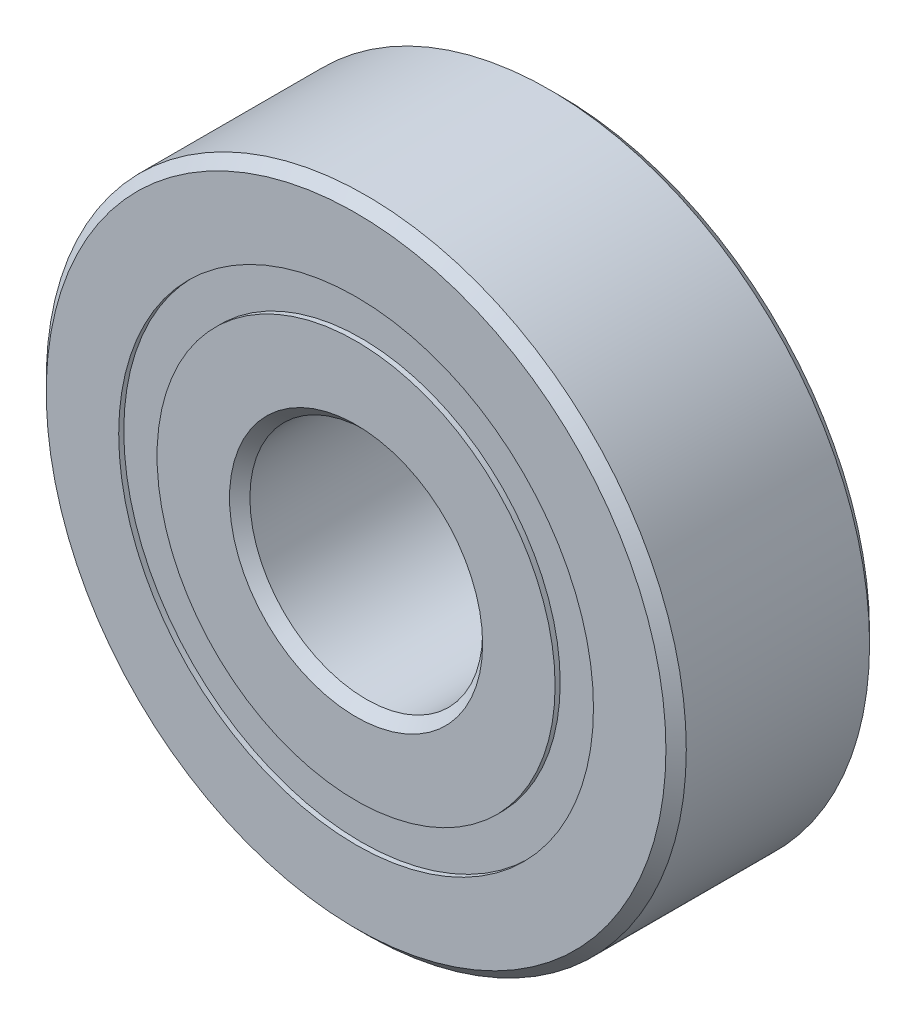
ISO-10303-21;
HEADER;
FILE_DESCRIPTION(('STEP AP214'),'2;1');
FILE_NAME('part.step','',(''),(''),'','','');
FILE_SCHEMA(('AUTOMOTIVE_DESIGN { 1 0 10303 214 1 1 1 1 }'));
ENDSEC;
DATA;
#1=APPLICATION_CONTEXT('core data for automotive mechanical design processes');
#2=APPLICATION_PROTOCOL_DEFINITION('international standard','automotive_design',2000,#1);
#3=PRODUCT_CONTEXT('',#1,'mechanical');
#4=PRODUCT('Part','Part','',(#3));
#5=PRODUCT_RELATED_PRODUCT_CATEGORY('part','',(#4));
#6=PRODUCT_DEFINITION_FORMATION('','',#4);
#7=PRODUCT_DEFINITION_CONTEXT('part definition',#1,'design');
#8=PRODUCT_DEFINITION('design','',#6,#7);
#9=PRODUCT_DEFINITION_SHAPE('','',#8);
#10=(LENGTH_UNIT() NAMED_UNIT(*) SI_UNIT(.MILLI.,.METRE.));
#11=(NAMED_UNIT(*) PLANE_ANGLE_UNIT() SI_UNIT($,.RADIAN.));
#12=(NAMED_UNIT(*) SI_UNIT($,.STERADIAN.) SOLID_ANGLE_UNIT());
#13=UNCERTAINTY_MEASURE_WITH_UNIT(LENGTH_MEASURE(1.E-05),#10,'distance_accuracy_value','');
#14=(GEOMETRIC_REPRESENTATION_CONTEXT(3) GLOBAL_UNCERTAINTY_ASSIGNED_CONTEXT((#13)) GLOBAL_UNIT_ASSIGNED_CONTEXT((#10,
#11,#12)) REPRESENTATION_CONTEXT('',''));
#15=CARTESIAN_POINT('',(0.,0.,0.));
#16=DIRECTION('',(0.,0.,1.));
#17=DIRECTION('',(1.,0.,0.));
#18=AXIS2_PLACEMENT_3D('',#15,#16,#17);
#19=CARTESIAN_POINT('',(0.,8.15934065934065,-3.32500000000001));
#20=DIRECTION('',(0.,0.,1.));
#21=DIRECTION('',(1.,0.,0.));
#22=AXIS2_PLACEMENT_3D('',#19,#20,#21);
#23=PLANE('',#22);
#24=CARTESIAN_POINT('',(0.,0.,-3.32500000000001));
#25=DIRECTION('',(0.,0.,1.));
#26=DIRECTION('',(1.,0.,0.));
#27=AXIS2_PLACEMENT_3D('',#24,#25,#26);
#28=CIRCLE('',#27,8.15934065934065);
#29=CARTESIAN_POINT('',(8.15934065934065,0.,-3.32500000000001));
#30=VERTEX_POINT('',#29);
#31=EDGE_CURVE('E58',#30,#30,#28,.T.);
#32=ORIENTED_EDGE('',*,*,#31,.F.);
#33=EDGE_LOOP('',(#32));
#34=FACE_BOUND('',#33,.T.);
#35=CARTESIAN_POINT('',(0.,0.,-3.32500000000001));
#36=DIRECTION('',(0.,0.,1.));
#37=DIRECTION('',(1.,0.,0.));
#38=AXIS2_PLACEMENT_3D('',#35,#36,#37);
#39=CIRCLE('',#38,6.84065934065934);
#40=CARTESIAN_POINT('',(6.84065934065934,0.,-3.32500000000001));
#41=VERTEX_POINT('',#40);
#42=EDGE_CURVE('E11',#41,#41,#39,.T.);
#43=ORIENTED_EDGE('',*,*,#42,.T.);
#44=EDGE_LOOP('',(#43));
#45=FACE_BOUND('',#44,.T.);
#46=ADVANCED_FACE('F44',(#34,#45),#23,.F.);
#47=CARTESIAN_POINT('',(0.,0.,3.5));
#48=DIRECTION('',(0.,0.,1.));
#49=DIRECTION('',(1.,0.,0.));
#50=AXIS2_PLACEMENT_3D('',#47,#48,#49);
#51=CYLINDRICAL_SURFACE('',#50,6.84065934065934);
#52=ORIENTED_EDGE('',*,*,#42,.F.);
#53=EDGE_LOOP('',(#52));
#54=FACE_BOUND('',#53,.T.);
#55=CARTESIAN_POINT('',(0.,0.,-1.68952158656809));
#56=DIRECTION('',(0.,0.,1.));
#57=DIRECTION('',(1.,0.,0.));
#58=AXIS2_PLACEMENT_3D('',#55,#56,#57);
#59=CIRCLE('',#58,6.84065934065934);
#60=CARTESIAN_POINT('',(6.84065934065934,0.,-1.68952158656809));
#61=VERTEX_POINT('',#60);
#62=EDGE_CURVE('E50',#61,#61,#59,.T.);
#63=ORIENTED_EDGE('',*,*,#62,.T.);
#64=EDGE_LOOP('',(#63));
#65=FACE_BOUND('',#64,.T.);
#66=ADVANCED_FACE('F67',(#54,#65),#51,.F.);
#67=CARTESIAN_POINT('',(0.,8.15934065934065,-1.68952158656809));
#68=DIRECTION('',(0.,0.,-1.));
#69=DIRECTION('',(-1.,0.,0.));
#70=AXIS2_PLACEMENT_3D('',#67,#68,#69);
#71=PLANE('',#70);
#72=ORIENTED_EDGE('',*,*,#62,.F.);
#73=EDGE_LOOP('',(#72));
#74=FACE_BOUND('',#73,.T.);
#75=CARTESIAN_POINT('',(0.,0.,-1.68952158656809));
#76=DIRECTION('',(0.,0.,1.));
#77=DIRECTION('',(1.,0.,0.));
#78=AXIS2_PLACEMENT_3D('',#75,#76,#77);
#79=CIRCLE('',#78,8.15934065934065);
#80=CARTESIAN_POINT('',(8.15934065934065,0.,-1.68952158656809));
#81=VERTEX_POINT('',#80);
#82=EDGE_CURVE('E54',#81,#81,#79,.T.);
#83=ORIENTED_EDGE('',*,*,#82,.T.);
#84=EDGE_LOOP('',(#83));
#85=FACE_BOUND('',#84,.T.);
#86=ADVANCED_FACE('F71',(#74,#85),#71,.F.);
#87=CARTESIAN_POINT('',(0.,0.,3.5));
#88=DIRECTION('',(0.,0.,1.));
#89=DIRECTION('',(1.,0.,0.));
#90=AXIS2_PLACEMENT_3D('',#87,#88,#89);
#91=CYLINDRICAL_SURFACE('',#90,8.15934065934065);
#92=ORIENTED_EDGE('',*,*,#82,.F.);
#93=EDGE_LOOP('',(#92));
#94=FACE_BOUND('',#93,.T.);
#95=ORIENTED_EDGE('',*,*,#31,.T.);
#96=EDGE_LOOP('',(#95));
#97=FACE_BOUND('',#96,.T.);
#98=ADVANCED_FACE('F64',(#94,#97),#91,.T.);
#99=CLOSED_SHELL('',(#46,#66,#86,#98));
#100=MANIFOLD_SOLID_BREP('B2_NOT_SHOWN',#99);
#101=CARTESIAN_POINT('',(0.,8.15934065934065,3.32499999999999));
#102=DIRECTION('',(0.,0.,-1.));
#103=DIRECTION('',(-1.,0.,0.));
#104=AXIS2_PLACEMENT_3D('',#101,#102,#103);
#105=PLANE('',#104);
#106=CARTESIAN_POINT('',(0.,0.,3.32499999999999));
#107=DIRECTION('',(0.,0.,1.));
#108=DIRECTION('',(1.,0.,0.));
#109=AXIS2_PLACEMENT_3D('',#106,#107,#108);
#110=CIRCLE('',#109,6.84065934065934);
#111=CARTESIAN_POINT('',(6.84065934065934,0.,3.32499999999999));
#112=VERTEX_POINT('',#111);
#113=EDGE_CURVE('E43',#112,#112,#110,.T.);
#114=ORIENTED_EDGE('',*,*,#113,.F.);
#115=EDGE_LOOP('',(#114));
#116=FACE_BOUND('',#115,.T.);
#117=CARTESIAN_POINT('',(0.,0.,3.32499999999999));
#118=DIRECTION('',(0.,0.,1.));
#119=DIRECTION('',(1.,0.,0.));
#120=AXIS2_PLACEMENT_3D('',#117,#118,#119);
#121=CIRCLE('',#120,8.15934065934065);
#122=CARTESIAN_POINT('',(8.15934065934065,0.,3.32499999999999));
#123=VERTEX_POINT('',#122);
#124=EDGE_CURVE('E126',#123,#123,#121,.T.);
#125=ORIENTED_EDGE('',*,*,#124,.T.);
#126=EDGE_LOOP('',(#125));
#127=FACE_BOUND('',#126,.T.);
#128=ADVANCED_FACE('F112',(#116,#127),#105,.F.);
#129=CARTESIAN_POINT('',(0.,0.,3.5));
#130=DIRECTION('',(0.,0.,1.));
#131=DIRECTION('',(1.,0.,0.));
#132=AXIS2_PLACEMENT_3D('',#129,#130,#131);
#133=CYLINDRICAL_SURFACE('',#132,6.84065934065934);
#134=CARTESIAN_POINT('',(0.,0.,1.68952158656808));
#135=DIRECTION('',(0.,0.,1.));
#136=DIRECTION('',(1.,0.,0.));
#137=AXIS2_PLACEMENT_3D('',#134,#135,#136);
#138=CIRCLE('',#137,6.84065934065934);
#139=CARTESIAN_POINT('',(6.84065934065934,0.,1.68952158656808));
#140=VERTEX_POINT('',#139);
#141=EDGE_CURVE('E118',#140,#140,#138,.T.);
#142=ORIENTED_EDGE('',*,*,#141,.F.);
#143=EDGE_LOOP('',(#142));
#144=FACE_BOUND('',#143,.T.);
#145=ORIENTED_EDGE('',*,*,#113,.T.);
#146=EDGE_LOOP('',(#145));
#147=FACE_BOUND('',#146,.T.);
#148=ADVANCED_FACE('F141',(#144,#147),#133,.F.);
#149=CARTESIAN_POINT('',(0.,8.15934065934065,1.68952158656808));
#150=DIRECTION('',(0.,0.,1.));
#151=DIRECTION('',(1.,0.,0.));
#152=AXIS2_PLACEMENT_3D('',#149,#150,#151);
#153=PLANE('',#152);
#154=CARTESIAN_POINT('',(0.,0.,1.68952158656808));
#155=DIRECTION('',(0.,0.,1.));
#156=DIRECTION('',(1.,0.,0.));
#157=AXIS2_PLACEMENT_3D('',#154,#155,#156);
#158=CIRCLE('',#157,8.15934065934065);
#159=CARTESIAN_POINT('',(8.15934065934065,0.,1.68952158656808));
#160=VERTEX_POINT('',#159);
#161=EDGE_CURVE('E122',#160,#160,#158,.T.);
#162=ORIENTED_EDGE('',*,*,#161,.F.);
#163=EDGE_LOOP('',(#162));
#164=FACE_BOUND('',#163,.T.);
#165=ORIENTED_EDGE('',*,*,#141,.T.);
#166=EDGE_LOOP('',(#165));
#167=FACE_BOUND('',#166,.T.);
#168=ADVANCED_FACE('F136',(#164,#167),#153,.F.);
#169=CARTESIAN_POINT('',(0.,0.,3.5));
#170=DIRECTION('',(0.,0.,1.));
#171=DIRECTION('',(1.,0.,0.));
#172=AXIS2_PLACEMENT_3D('',#169,#170,#171);
#173=CYLINDRICAL_SURFACE('',#172,8.15934065934065);
#174=ORIENTED_EDGE('',*,*,#124,.F.);
#175=EDGE_LOOP('',(#174));
#176=FACE_BOUND('',#175,.T.);
#177=ORIENTED_EDGE('',*,*,#161,.T.);
#178=EDGE_LOOP('',(#177));
#179=FACE_BOUND('',#178,.T.);
#180=ADVANCED_FACE('F133',(#176,#179),#173,.T.);
#181=CLOSED_SHELL('',(#128,#148,#168,#180));
#182=MANIFOLD_SOLID_BREP('B6_NOT_SHOWN',#181);
#183=CARTESIAN_POINT('',(-4.40838939219346,6.06762745781216,0.));
#184=DIRECTION('',(0.,0.,1.));
#185=DIRECTION('',(-0.587785252292462,0.809016994374955,0.));
#186=AXIS2_PLACEMENT_3D('',#183,#184,#185);
#187=SPHERICAL_SURFACE('',#186,1.68952158656808);
#188=CARTESIAN_POINT('',(-4.40838939219346,6.06762745781216,1.68952158656808));
#189=VERTEX_POINT('',#188);
#190=VERTEX_LOOP('',#189);
#191=FACE_BOUND('',#190,.T.);
#192=ADVANCED_FACE('F180',(#191),#187,.T.);
#193=CLOSED_SHELL('',(#192));
#194=MANIFOLD_SOLID_BREP('B38',#193);
#195=CARTESIAN_POINT('',(-7.13292387221362,2.31762745781218,0.));
#196=DIRECTION('',(0.,0.,1.));
#197=DIRECTION('',(-0.95105651629515,0.309016994374958,0.));
#198=AXIS2_PLACEMENT_3D('',#195,#196,#197);
#199=SPHERICAL_SURFACE('',#198,1.68952158656808);
#200=CARTESIAN_POINT('',(-7.13292387221362,2.31762745781218,1.68952158656808));
#201=VERTEX_POINT('',#200);
#202=VERTEX_LOOP('',#201);
#203=FACE_BOUND('',#202,.T.);
#204=ADVANCED_FACE('F201',(#203),#199,.T.);
#205=CLOSED_SHELL('',(#204));
#206=MANIFOLD_SOLID_BREP('B108',#205);
#207=CARTESIAN_POINT('',(-7.13292387221367,-2.31762745781203,0.));
#208=DIRECTION('',(0.,0.,1.));
#209=DIRECTION('',(-0.951056516295157,-0.309016994374938,0.));
#210=AXIS2_PLACEMENT_3D('',#207,#208,#209);
#211=SPHERICAL_SURFACE('',#210,1.68952158656808);
#212=CARTESIAN_POINT('',(-7.13292387221367,-2.31762745781203,1.68952158656808));
#213=VERTEX_POINT('',#212);
#214=VERTEX_LOOP('',#213);
#215=FACE_BOUND('',#214,.T.);
#216=ADVANCED_FACE('F222',(#215),#211,.T.);
#217=CLOSED_SHELL('',(#216));
#218=MANIFOLD_SOLID_BREP('B176',#217);
#219=CARTESIAN_POINT('',(-4.4083893921936,-6.06762745781206,0.));
#220=DIRECTION('',(0.,0.,1.));
#221=DIRECTION('',(-0.58778525229248,-0.809016994374942,0.));
#222=AXIS2_PLACEMENT_3D('',#219,#220,#221);
#223=SPHERICAL_SURFACE('',#222,1.68952158656808);
#224=CARTESIAN_POINT('',(-4.4083893921936,-6.06762745781206,1.68952158656808));
#225=VERTEX_POINT('',#224);
#226=VERTEX_LOOP('',#225);
#227=FACE_BOUND('',#226,.T.);
#228=ADVANCED_FACE('F243',(#227),#223,.T.);
#229=CLOSED_SHELL('',(#228));
#230=MANIFOLD_SOLID_BREP('B197',#229);
#231=CARTESIAN_POINT('',(0.,-7.49999999999999,0.));
#232=DIRECTION('',(0.,0.,1.));
#233=DIRECTION('',(0.,-1.,0.));
#234=AXIS2_PLACEMENT_3D('',#231,#232,#233);
#235=SPHERICAL_SURFACE('',#234,1.68952158656808);
#236=CARTESIAN_POINT('',(0.,-7.49999999999999,1.68952158656808));
#237=VERTEX_POINT('',#236);
#238=VERTEX_LOOP('',#237);
#239=FACE_BOUND('',#238,.T.);
#240=ADVANCED_FACE('F264',(#239),#235,.T.);
#241=CLOSED_SHELL('',(#240));
#242=MANIFOLD_SOLID_BREP('B218',#241);
#243=CARTESIAN_POINT('',(4.40838939219351,-6.06762745781212,0.));
#244=DIRECTION('',(0.,0.,1.));
#245=DIRECTION('',(0.587785252292469,-0.809016994374951,0.));
#246=AXIS2_PLACEMENT_3D('',#243,#244,#245);
#247=SPHERICAL_SURFACE('',#246,1.68952158656808);
#248=CARTESIAN_POINT('',(4.40838939219351,-6.06762745781212,1.68952158656808));
#249=VERTEX_POINT('',#248);
#250=VERTEX_LOOP('',#249);
#251=FACE_BOUND('',#250,.T.);
#252=ADVANCED_FACE('F285',(#251),#247,.T.);
#253=CLOSED_SHELL('',(#252));
#254=MANIFOLD_SOLID_BREP('B239',#253);
#255=CARTESIAN_POINT('',(7.13292387221364,-2.31762745781214,0.));
#256=DIRECTION('',(0.,0.,1.));
#257=DIRECTION('',(0.951056516295152,-0.309016994374952,0.));
#258=AXIS2_PLACEMENT_3D('',#255,#256,#257);
#259=SPHERICAL_SURFACE('',#258,1.68952158656808);
#260=CARTESIAN_POINT('',(7.13292387221364,-2.31762745781214,1.68952158656808));
#261=VERTEX_POINT('',#260);
#262=VERTEX_LOOP('',#261);
#263=FACE_BOUND('',#262,.T.);
#264=ADVANCED_FACE('F306',(#263),#259,.T.);
#265=CLOSED_SHELL('',(#264));
#266=MANIFOLD_SOLID_BREP('B260',#265);
#267=CARTESIAN_POINT('',(7.13292387221365,2.31762745781208,0.));
#268=DIRECTION('',(0.,0.,1.));
#269=DIRECTION('',(0.951056516295155,0.309016994374945,0.));
#270=AXIS2_PLACEMENT_3D('',#267,#268,#269);
#271=SPHERICAL_SURFACE('',#270,1.68952158656808);
#272=CARTESIAN_POINT('',(7.13292387221365,2.31762745781208,1.68952158656808));
#273=VERTEX_POINT('',#272);
#274=VERTEX_LOOP('',#273);
#275=FACE_BOUND('',#274,.T.);
#276=ADVANCED_FACE('F327',(#275),#271,.T.);
#277=CLOSED_SHELL('',(#276));
#278=MANIFOLD_SOLID_BREP('B281',#277);
#279=CARTESIAN_POINT('',(4.40838939219355,6.0676274578121,0.));
#280=DIRECTION('',(0.,0.,1.));
#281=DIRECTION('',(0.587785252292474,0.809016994374947,0.));
#282=AXIS2_PLACEMENT_3D('',#279,#280,#281);
#283=SPHERICAL_SURFACE('',#282,1.68952158656808);
#284=CARTESIAN_POINT('',(4.40838939219355,6.0676274578121,1.68952158656808));
#285=VERTEX_POINT('',#284);
#286=VERTEX_LOOP('',#285);
#287=FACE_BOUND('',#286,.T.);
#288=ADVANCED_FACE('F348',(#287),#283,.T.);
#289=CLOSED_SHELL('',(#288));
#290=MANIFOLD_SOLID_BREP('B302',#289);
#291=CARTESIAN_POINT('',(0.,7.49999999999999,0.));
#292=DIRECTION('',(0.,0.,1.));
#293=DIRECTION('',(0.,1.,0.));
#294=AXIS2_PLACEMENT_3D('',#291,#292,#293);
#295=SPHERICAL_SURFACE('',#294,1.68952158656808);
#296=CARTESIAN_POINT('',(0.,7.49999999999999,1.68952158656808));
#297=VERTEX_POINT('',#296);
#298=VERTEX_LOOP('',#297);
#299=FACE_BOUND('',#298,.T.);
#300=ADVANCED_FACE('F371',(#299),#295,.T.);
#301=CLOSED_SHELL('',(#300));
#302=MANIFOLD_SOLID_BREP('B323',#301);
#303=CARTESIAN_POINT('',(0.,6.84065934065934,3.50000000000001));
#304=DIRECTION('',(0.,0.,-1.));
#305=DIRECTION('',(-1.,0.,0.));
#306=AXIS2_PLACEMENT_3D('',#303,#304,#305);
#307=PLANE('',#306);
#308=CARTESIAN_POINT('',(0.,0.,3.50000000000001));
#309=DIRECTION('',(0.,0.,1.));
#310=DIRECTION('',(1.,0.,0.));
#311=AXIS2_PLACEMENT_3D('',#308,#309,#310);
#312=CIRCLE('',#311,4.35);
#313=CARTESIAN_POINT('',(4.35,0.,3.50000000000001));
#314=VERTEX_POINT('',#313);
#315=EDGE_CURVE('E419',#314,#314,#312,.T.);
#316=ORIENTED_EDGE('',*,*,#315,.F.);
#317=EDGE_LOOP('',(#316));
#318=FACE_BOUND('',#317,.T.);
#319=CARTESIAN_POINT('',(0.,0.,3.50000000000001));
#320=DIRECTION('',(0.,0.,1.));
#321=DIRECTION('',(1.,0.,0.));
#322=AXIS2_PLACEMENT_3D('',#319,#320,#321);
#323=CIRCLE('',#322,6.84065934065934);
#324=CARTESIAN_POINT('',(6.84065934065934,0.,3.50000000000001));
#325=VERTEX_POINT('',#324);
#326=EDGE_CURVE('E370',#325,#325,#323,.T.);
#327=ORIENTED_EDGE('',*,*,#326,.T.);
#328=EDGE_LOOP('',(#327));
#329=FACE_BOUND('',#328,.T.);
#330=ADVANCED_FACE('F391',(#318,#329),#307,.F.);
#331=CARTESIAN_POINT('',(0.,0.,3.5));
#332=DIRECTION('',(0.,0.,1.));
#333=DIRECTION('',(1.,0.,0.));
#334=AXIS2_PLACEMENT_3D('',#331,#332,#333);
#335=CYLINDRICAL_SURFACE('',#334,6.84065934065934);
#336=ORIENTED_EDGE('',*,*,#326,.F.);
#337=EDGE_LOOP('',(#336));
#338=FACE_BOUND('',#337,.T.);
#339=CARTESIAN_POINT('',(0.,0.,1.55555555555555));
#340=DIRECTION('',(0.,0.,1.));
#341=DIRECTION('',(1.,0.,0.));
#342=AXIS2_PLACEMENT_3D('',#339,#340,#341);
#343=CIRCLE('',#342,6.84065934065935);
#344=CARTESIAN_POINT('',(6.84065934065935,0.,1.55555555555555));
#345=VERTEX_POINT('',#344);
#346=EDGE_CURVE('E397',#345,#345,#343,.T.);
#347=ORIENTED_EDGE('',*,*,#346,.T.);
#348=EDGE_LOOP('',(#347));
#349=FACE_BOUND('',#348,.T.);
#350=ADVANCED_FACE('F426',(#338,#349),#335,.T.);
#351=CARTESIAN_POINT('',(0.,0.,0.));
#352=DIRECTION('',(0.,0.,1.));
#353=DIRECTION('',(1.,0.,0.));
#354=AXIS2_PLACEMENT_3D('',#351,#352,#353);
#355=TOROIDAL_SURFACE('',#354,7.5,1.68952158656807);
#356=ORIENTED_EDGE('',*,*,#346,.F.);
#357=EDGE_LOOP('',(#356));
#358=FACE_BOUND('',#357,.T.);
#359=CARTESIAN_POINT('',(0.,0.,-1.55555555555556));
#360=DIRECTION('',(0.,0.,1.));
#361=DIRECTION('',(1.,0.,0.));
#362=AXIS2_PLACEMENT_3D('',#359,#360,#361);
#363=CIRCLE('',#362,6.84065934065934);
#364=CARTESIAN_POINT('',(6.84065934065934,0.,-1.55555555555556));
#365=VERTEX_POINT('',#364);
#366=EDGE_CURVE('E401',#365,#365,#363,.T.);
#367=ORIENTED_EDGE('',*,*,#366,.T.);
#368=EDGE_LOOP('',(#367));
#369=FACE_BOUND('',#368,.T.);
#370=ADVANCED_FACE('F430',(#358,#369),#355,.F.);
#371=CARTESIAN_POINT('',(0.,0.,3.5));
#372=DIRECTION('',(0.,0.,1.));
#373=DIRECTION('',(1.,0.,0.));
#374=AXIS2_PLACEMENT_3D('',#371,#372,#373);
#375=CYLINDRICAL_SURFACE('',#374,6.84065934065934);
#376=ORIENTED_EDGE('',*,*,#366,.F.);
#377=EDGE_LOOP('',(#376));
#378=FACE_BOUND('',#377,.T.);
#379=CARTESIAN_POINT('',(0.,0.,-3.50000000000001));
#380=DIRECTION('',(0.,0.,1.));
#381=DIRECTION('',(1.,0.,0.));
#382=AXIS2_PLACEMENT_3D('',#379,#380,#381);
#383=CIRCLE('',#382,6.84065934065934);
#384=CARTESIAN_POINT('',(6.84065934065934,0.,-3.50000000000001));
#385=VERTEX_POINT('',#384);
#386=EDGE_CURVE('E405',#385,#385,#383,.T.);
#387=ORIENTED_EDGE('',*,*,#386,.T.);
#388=EDGE_LOOP('',(#387));
#389=FACE_BOUND('',#388,.T.);
#390=ADVANCED_FACE('F435',(#378,#389),#375,.T.);
#391=CARTESIAN_POINT('',(0.,4.35,-3.50000000000001));
#392=DIRECTION('',(0.,0.,1.));
#393=DIRECTION('',(1.,0.,0.));
#394=AXIS2_PLACEMENT_3D('',#391,#392,#393);
#395=PLANE('',#394);
#396=ORIENTED_EDGE('',*,*,#386,.F.);
#397=EDGE_LOOP('',(#396));
#398=FACE_BOUND('',#397,.T.);
#399=CARTESIAN_POINT('',(0.,0.,-3.50000000000001));
#400=DIRECTION('',(0.,0.,1.));
#401=DIRECTION('',(1.,0.,0.));
#402=AXIS2_PLACEMENT_3D('',#399,#400,#401);
#403=CIRCLE('',#402,4.35);
#404=CARTESIAN_POINT('',(4.35,0.,-3.50000000000001));
#405=VERTEX_POINT('',#404);
#406=EDGE_CURVE('E410',#405,#405,#403,.T.);
#407=ORIENTED_EDGE('',*,*,#406,.T.);
#408=EDGE_LOOP('',(#407));
#409=FACE_BOUND('',#408,.T.);
#410=ADVANCED_FACE('F441',(#398,#409),#395,.F.);
#411=CARTESIAN_POINT('',(0.,0.,-3.15000000000001));
#412=DIRECTION('',(0.,0.,-1.));
#413=DIRECTION('',(-1.,0.,0.));
#414=AXIS2_PLACEMENT_3D('',#411,#412,#413);
#415=CONICAL_SURFACE('',#414,4.,0.785398163397453);
#416=ORIENTED_EDGE('',*,*,#406,.F.);
#417=EDGE_LOOP('',(#416));
#418=FACE_BOUND('',#417,.T.);
#419=CARTESIAN_POINT('',(0.,0.,-3.15000000000001));
#420=DIRECTION('',(0.,0.,1.));
#421=DIRECTION('',(1.,0.,0.));
#422=AXIS2_PLACEMENT_3D('',#419,#420,#421);
#423=CIRCLE('',#422,4.);
#424=CARTESIAN_POINT('',(4.,0.,-3.15000000000001));
#425=VERTEX_POINT('',#424);
#426=EDGE_CURVE('E413',#425,#425,#423,.T.);
#427=ORIENTED_EDGE('',*,*,#426,.T.);
#428=EDGE_LOOP('',(#427));
#429=FACE_BOUND('',#428,.T.);
#430=ADVANCED_FACE('F445',(#418,#429),#415,.F.);
#431=CARTESIAN_POINT('',(0.,0.,3.5));
#432=DIRECTION('',(0.,0.,1.));
#433=DIRECTION('',(1.,0.,0.));
#434=AXIS2_PLACEMENT_3D('',#431,#432,#433);
#435=CYLINDRICAL_SURFACE('',#434,4.);
#436=ORIENTED_EDGE('',*,*,#426,.F.);
#437=EDGE_LOOP('',(#436));
#438=FACE_BOUND('',#437,.T.);
#439=CARTESIAN_POINT('',(0.,0.,3.15000000000001));
#440=DIRECTION('',(0.,0.,1.));
#441=DIRECTION('',(1.,0.,0.));
#442=AXIS2_PLACEMENT_3D('',#439,#440,#441);
#443=CIRCLE('',#442,4.);
#444=CARTESIAN_POINT('',(4.,0.,3.15000000000001));
#445=VERTEX_POINT('',#444);
#446=EDGE_CURVE('E416',#445,#445,#443,.T.);
#447=ORIENTED_EDGE('',*,*,#446,.T.);
#448=EDGE_LOOP('',(#447));
#449=FACE_BOUND('',#448,.T.);
#450=ADVANCED_FACE('F449',(#438,#449),#435,.F.);
#451=CARTESIAN_POINT('',(0.,0.,3.50000000000001));
#452=DIRECTION('',(0.,0.,1.));
#453=DIRECTION('',(1.,0.,0.));
#454=AXIS2_PLACEMENT_3D('',#451,#452,#453);
#455=CONICAL_SURFACE('',#454,4.35,0.785398163397453);
#456=ORIENTED_EDGE('',*,*,#446,.F.);
#457=EDGE_LOOP('',(#456));
#458=FACE_BOUND('',#457,.T.);
#459=ORIENTED_EDGE('',*,*,#315,.T.);
#460=EDGE_LOOP('',(#459));
#461=FACE_BOUND('',#460,.T.);
#462=ADVANCED_FACE('F423',(#458,#461),#455,.F.);
#463=CLOSED_SHELL('',(#330,#350,#370,#390,#410,#430,#450,#462));
#464=MANIFOLD_SOLID_BREP('B344',#463);
#465=CARTESIAN_POINT('',(0.,0.,3.15));
#466=DIRECTION('',(0.,0.,-1.));
#467=DIRECTION('',(-1.,0.,0.));
#468=AXIS2_PLACEMENT_3D('',#465,#466,#467);
#469=CONICAL_SURFACE('',#468,11.,0.785398163397453);
#470=CARTESIAN_POINT('',(0.,0.,3.5));
#471=DIRECTION('',(0.,0.,1.));
#472=DIRECTION('',(1.,0.,0.));
#473=AXIS2_PLACEMENT_3D('',#470,#471,#472);
#474=CIRCLE('',#473,10.65);
#475=CARTESIAN_POINT('',(10.65,0.,3.5));
#476=VERTEX_POINT('',#475);
#477=EDGE_CURVE('E541',#476,#476,#474,.T.);
#478=ORIENTED_EDGE('',*,*,#477,.F.);
#479=EDGE_LOOP('',(#478));
#480=FACE_BOUND('',#479,.T.);
#481=CARTESIAN_POINT('',(0.,0.,3.15));
#482=DIRECTION('',(0.,0.,1.));
#483=DIRECTION('',(1.,0.,0.));
#484=AXIS2_PLACEMENT_3D('',#481,#482,#483);
#485=CIRCLE('',#484,11.);
#486=CARTESIAN_POINT('',(11.,0.,3.15));
#487=VERTEX_POINT('',#486);
#488=EDGE_CURVE('E390',#487,#487,#485,.T.);
#489=ORIENTED_EDGE('',*,*,#488,.T.);
#490=EDGE_LOOP('',(#489));
#491=FACE_BOUND('',#490,.T.);
#492=ADVANCED_FACE('F513',(#480,#491),#469,.T.);
#493=CARTESIAN_POINT('',(0.,0.,3.5));
#494=DIRECTION('',(0.,0.,1.));
#495=DIRECTION('',(1.,0.,0.));
#496=AXIS2_PLACEMENT_3D('',#493,#494,#495);
#497=CYLINDRICAL_SURFACE('',#496,11.);
#498=ORIENTED_EDGE('',*,*,#488,.F.);
#499=EDGE_LOOP('',(#498));
#500=FACE_BOUND('',#499,.T.);
#501=CARTESIAN_POINT('',(0.,0.,-3.15000000000001));
#502=DIRECTION('',(0.,0.,1.));
#503=DIRECTION('',(1.,0.,0.));
#504=AXIS2_PLACEMENT_3D('',#501,#502,#503);
#505=CIRCLE('',#504,11.);
#506=CARTESIAN_POINT('',(11.,0.,-3.15000000000001));
#507=VERTEX_POINT('',#506);
#508=EDGE_CURVE('E519',#507,#507,#505,.T.);
#509=ORIENTED_EDGE('',*,*,#508,.T.);
#510=EDGE_LOOP('',(#509));
#511=FACE_BOUND('',#510,.T.);
#512=ADVANCED_FACE('F548',(#500,#511),#497,.T.);
#513=CARTESIAN_POINT('',(0.,0.,-3.50000000000001));
#514=DIRECTION('',(0.,0.,1.));
#515=DIRECTION('',(1.,0.,0.));
#516=AXIS2_PLACEMENT_3D('',#513,#514,#515);
#517=CONICAL_SURFACE('',#516,10.65,0.785398163397453);
#518=ORIENTED_EDGE('',*,*,#508,.F.);
#519=EDGE_LOOP('',(#518));
#520=FACE_BOUND('',#519,.T.);
#521=CARTESIAN_POINT('',(0.,0.,-3.50000000000001));
#522=DIRECTION('',(0.,0.,1.));
#523=DIRECTION('',(1.,0.,0.));
#524=AXIS2_PLACEMENT_3D('',#521,#522,#523);
#525=CIRCLE('',#524,10.65);
#526=CARTESIAN_POINT('',(10.65,0.,-3.50000000000001));
#527=VERTEX_POINT('',#526);
#528=EDGE_CURVE('E523',#527,#527,#525,.T.);
#529=ORIENTED_EDGE('',*,*,#528,.T.);
#530=EDGE_LOOP('',(#529));
#531=FACE_BOUND('',#530,.T.);
#532=ADVANCED_FACE('F552',(#520,#531),#517,.T.);
#533=CARTESIAN_POINT('',(0.,10.65,-3.50000000000001));
#534=DIRECTION('',(0.,0.,1.));
#535=DIRECTION('',(1.,0.,0.));
#536=AXIS2_PLACEMENT_3D('',#533,#534,#535);
#537=PLANE('',#536);
#538=ORIENTED_EDGE('',*,*,#528,.F.);
#539=EDGE_LOOP('',(#538));
#540=FACE_BOUND('',#539,.T.);
#541=CARTESIAN_POINT('',(0.,0.,-3.50000000000001));
#542=DIRECTION('',(0.,0.,1.));
#543=DIRECTION('',(1.,0.,0.));
#544=AXIS2_PLACEMENT_3D('',#541,#542,#543);
#545=CIRCLE('',#544,8.15934065934065);
#546=CARTESIAN_POINT('',(8.15934065934065,0.,-3.50000000000001));
#547=VERTEX_POINT('',#546);
#548=EDGE_CURVE('E527',#547,#547,#545,.T.);
#549=ORIENTED_EDGE('',*,*,#548,.T.);
#550=EDGE_LOOP('',(#549));
#551=FACE_BOUND('',#550,.T.);
#552=ADVANCED_FACE('F557',(#540,#551),#537,.F.);
#553=CARTESIAN_POINT('',(0.,0.,3.5));
#554=DIRECTION('',(0.,0.,1.));
#555=DIRECTION('',(1.,0.,0.));
#556=AXIS2_PLACEMENT_3D('',#553,#554,#555);
#557=CYLINDRICAL_SURFACE('',#556,8.15934065934065);
#558=ORIENTED_EDGE('',*,*,#548,.F.);
#559=EDGE_LOOP('',(#558));
#560=FACE_BOUND('',#559,.T.);
#561=CARTESIAN_POINT('',(0.,0.,-1.55555555555556));
#562=DIRECTION('',(0.,0.,1.));
#563=DIRECTION('',(1.,0.,0.));
#564=AXIS2_PLACEMENT_3D('',#561,#562,#563);
#565=CIRCLE('',#564,8.15934065934065);
#566=CARTESIAN_POINT('',(8.15934065934065,0.,-1.55555555555556));
#567=VERTEX_POINT('',#566);
#568=EDGE_CURVE('E532',#567,#567,#565,.T.);
#569=ORIENTED_EDGE('',*,*,#568,.T.);
#570=EDGE_LOOP('',(#569));
#571=FACE_BOUND('',#570,.T.);
#572=ADVANCED_FACE('F563',(#560,#571),#557,.F.);
#573=CARTESIAN_POINT('',(0.,0.,0.));
#574=DIRECTION('',(0.,0.,1.));
#575=DIRECTION('',(1.,0.,0.));
#576=AXIS2_PLACEMENT_3D('',#573,#574,#575);
#577=TOROIDAL_SURFACE('',#576,7.49999999999999,1.68952158656808);
#578=ORIENTED_EDGE('',*,*,#568,.F.);
#579=EDGE_LOOP('',(#578));
#580=FACE_BOUND('',#579,.T.);
#581=CARTESIAN_POINT('',(0.,0.,1.55555555555555));
#582=DIRECTION('',(0.,0.,1.));
#583=DIRECTION('',(1.,0.,0.));
#584=AXIS2_PLACEMENT_3D('',#581,#582,#583);
#585=CIRCLE('',#584,8.15934065934065);
#586=CARTESIAN_POINT('',(8.15934065934065,0.,1.55555555555555));
#587=VERTEX_POINT('',#586);
#588=EDGE_CURVE('E535',#587,#587,#585,.T.);
#589=ORIENTED_EDGE('',*,*,#588,.T.);
#590=EDGE_LOOP('',(#589));
#591=FACE_BOUND('',#590,.T.);
#592=ADVANCED_FACE('F567',(#580,#591),#577,.F.);
#593=CARTESIAN_POINT('',(0.,0.,3.5));
#594=DIRECTION('',(0.,0.,1.));
#595=DIRECTION('',(1.,0.,0.));
#596=AXIS2_PLACEMENT_3D('',#593,#594,#595);
#597=CYLINDRICAL_SURFACE('',#596,8.15934065934065);
#598=ORIENTED_EDGE('',*,*,#588,.F.);
#599=EDGE_LOOP('',(#598));
#600=FACE_BOUND('',#599,.T.);
#601=CARTESIAN_POINT('',(0.,0.,3.5));
#602=DIRECTION('',(0.,0.,1.));
#603=DIRECTION('',(1.,0.,0.));
#604=AXIS2_PLACEMENT_3D('',#601,#602,#603);
#605=CIRCLE('',#604,8.15934065934065);
#606=CARTESIAN_POINT('',(8.15934065934065,0.,3.5));
#607=VERTEX_POINT('',#606);
#608=EDGE_CURVE('E538',#607,#607,#605,.T.);
#609=ORIENTED_EDGE('',*,*,#608,.T.);
#610=EDGE_LOOP('',(#609));
#611=FACE_BOUND('',#610,.T.);
#612=ADVANCED_FACE('F571',(#600,#611),#597,.F.);
#613=CARTESIAN_POINT('',(0.,10.65,3.5));
#614=DIRECTION('',(0.,0.,-1.));
#615=DIRECTION('',(-1.,0.,0.));
#616=AXIS2_PLACEMENT_3D('',#613,#614,#615);
#617=PLANE('',#616);
#618=ORIENTED_EDGE('',*,*,#608,.F.);
#619=EDGE_LOOP('',(#618));
#620=FACE_BOUND('',#619,.T.);
#621=ORIENTED_EDGE('',*,*,#477,.T.);
#622=EDGE_LOOP('',(#621));
#623=FACE_BOUND('',#622,.T.);
#624=ADVANCED_FACE('F545',(#620,#623),#617,.F.);
#625=CLOSED_SHELL('',(#492,#512,#532,#552,#572,#592,#612,#624));
#626=MANIFOLD_SOLID_BREP('B365',#625);
#627=ADVANCED_BREP_SHAPE_REPRESENTATION('',(#18,#100,#182,#194,#206,#218,#230,#242,#254,#266,
#278,#290,#302,#464,#626),#14);
#628=SHAPE_DEFINITION_REPRESENTATION(#9,#627);
ENDSEC;
END-ISO-10303-21;
